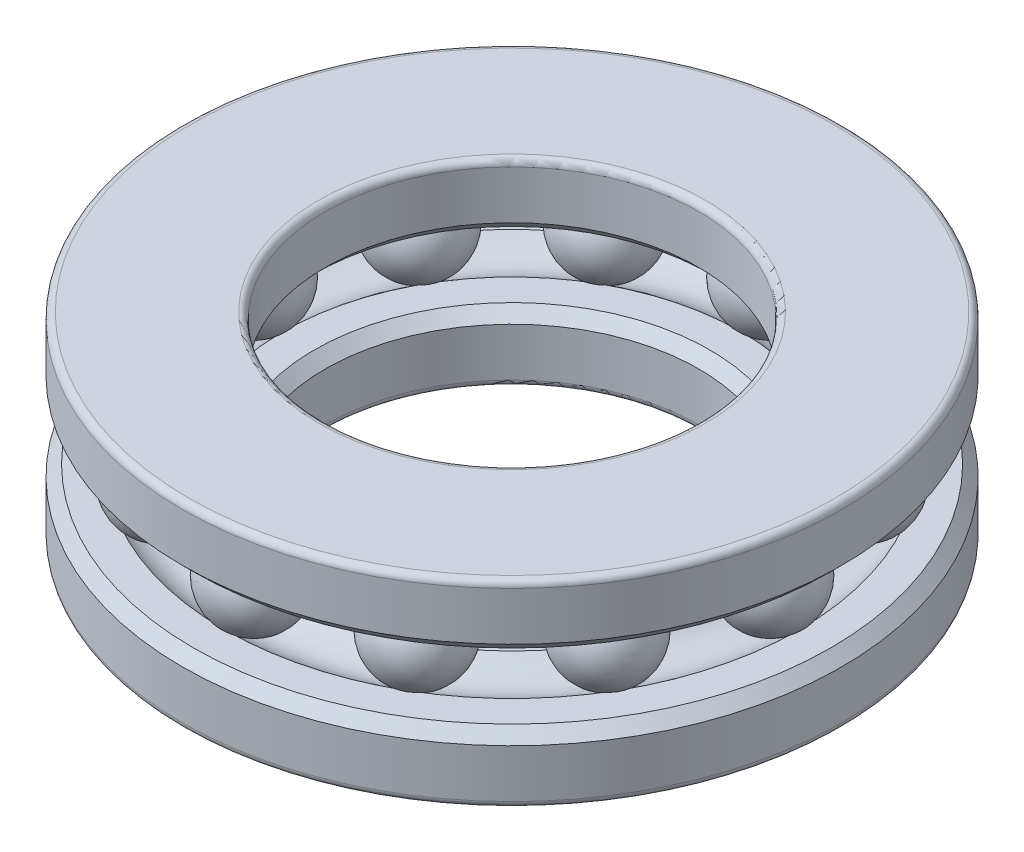
ISO-10303-21;
HEADER;
FILE_DESCRIPTION(('STEP AP214'),'2;1');
FILE_NAME('part.step','',(''),(''),'','','');
FILE_SCHEMA(('AUTOMOTIVE_DESIGN { 1 0 10303 214 1 1 1 1 }'));
ENDSEC;
DATA;
#1=APPLICATION_CONTEXT('core data for automotive mechanical design processes');
#2=APPLICATION_PROTOCOL_DEFINITION('international standard','automotive_design',2000,#1);
#3=PRODUCT_CONTEXT('',#1,'mechanical');
#4=PRODUCT('Part','Part','',(#3));
#5=PRODUCT_RELATED_PRODUCT_CATEGORY('part','',(#4));
#6=PRODUCT_DEFINITION_FORMATION('','',#4);
#7=PRODUCT_DEFINITION_CONTEXT('part definition',#1,'design');
#8=PRODUCT_DEFINITION('design','',#6,#7);
#9=PRODUCT_DEFINITION_SHAPE('','',#8);
#10=(LENGTH_UNIT() NAMED_UNIT(*) SI_UNIT(.MILLI.,.METRE.));
#11=(NAMED_UNIT(*) PLANE_ANGLE_UNIT() SI_UNIT($,.RADIAN.));
#12=(NAMED_UNIT(*) SI_UNIT($,.STERADIAN.) SOLID_ANGLE_UNIT());
#13=UNCERTAINTY_MEASURE_WITH_UNIT(LENGTH_MEASURE(1.E-05),#10,'distance_accuracy_value','');
#14=(GEOMETRIC_REPRESENTATION_CONTEXT(3) GLOBAL_UNCERTAINTY_ASSIGNED_CONTEXT((#13)) GLOBAL_UNIT_ASSIGNED_CONTEXT((#10,
#11,#12)) REPRESENTATION_CONTEXT('',''));
#15=CARTESIAN_POINT('',(0.,0.,0.));
#16=DIRECTION('',(0.,0.,1.));
#17=DIRECTION('',(1.,0.,0.));
#18=AXIS2_PLACEMENT_3D('',#15,#16,#17);
#19=CARTESIAN_POINT('',(5.87499999999987,0.,10.1757984944672));
#20=DIRECTION('',(0.,-1.,0.));
#21=DIRECTION('',(0.499999999999989,0.,0.866025403784445));
#22=AXIS2_PLACEMENT_3D('',#19,#20,#21);
#23=SPHERICAL_SURFACE('',#22,2.05);
#24=CARTESIAN_POINT('',(5.87499999999987,-2.05,10.1757984944672));
#25=VERTEX_POINT('',#24);
#26=VERTEX_LOOP('',#25);
#27=FACE_BOUND('',#26,.T.);
#28=ADVANCED_FACE('F40',(#27),#23,.T.);
#29=CLOSED_SHELL('',(#28));
#30=MANIFOLD_SOLID_BREP('B2',#29);
#31=CARTESIAN_POINT('',(10.1757984944671,0.,5.87500000000012));
#32=DIRECTION('',(0.,-1.,0.));
#33=DIRECTION('',(0.866025403784433,0.,0.50000000000001));
#34=AXIS2_PLACEMENT_3D('',#31,#32,#33);
#35=SPHERICAL_SURFACE('',#34,2.05);
#36=CARTESIAN_POINT('',(10.1757984944671,-2.05,5.87500000000012));
#37=VERTEX_POINT('',#36);
#38=VERTEX_LOOP('',#37);
#39=FACE_BOUND('',#38,.T.);
#40=ADVANCED_FACE('F59',(#39),#35,.T.);
#41=CLOSED_SHELL('',(#40));
#42=MANIFOLD_SOLID_BREP('B6',#41);
#43=CARTESIAN_POINT('',(11.75,0.,1.2307471719422E-13));
#44=DIRECTION('',(0.,-1.,0.));
#45=DIRECTION('',(1.,0.,0.));
#46=AXIS2_PLACEMENT_3D('',#43,#44,#45);
#47=SPHERICAL_SURFACE('',#46,2.05);
#48=CARTESIAN_POINT('',(11.75,-2.05,1.2307471719422E-13));
#49=VERTEX_POINT('',#48);
#50=VERTEX_LOOP('',#49);
#51=FACE_BOUND('',#50,.T.);
#52=ADVANCED_FACE('F78',(#51),#47,.T.);
#53=CLOSED_SHELL('',(#52));
#54=MANIFOLD_SOLID_BREP('B36',#53);
#55=CARTESIAN_POINT('',(10.1757984944672,0.,-5.8749999999999));
#56=DIRECTION('',(0.,-1.,0.));
#57=DIRECTION('',(0.866025403784443,0.,-0.499999999999992));
#58=AXIS2_PLACEMENT_3D('',#55,#56,#57);
#59=SPHERICAL_SURFACE('',#58,2.05);
#60=CARTESIAN_POINT('',(10.1757984944672,-2.05,-5.8749999999999));
#61=VERTEX_POINT('',#60);
#62=VERTEX_LOOP('',#61);
#63=FACE_BOUND('',#62,.T.);
#64=ADVANCED_FACE('F97',(#63),#59,.T.);
#65=CLOSED_SHELL('',(#64));
#66=MANIFOLD_SOLID_BREP('B55',#65);
#67=CARTESIAN_POINT('',(5.87500000000008,0.,-10.1757984944671));
#68=DIRECTION('',(0.,-1.,0.));
#69=DIRECTION('',(0.500000000000007,0.,-0.866025403784435));
#70=AXIS2_PLACEMENT_3D('',#67,#68,#69);
#71=SPHERICAL_SURFACE('',#70,2.05);
#72=CARTESIAN_POINT('',(5.87500000000008,-2.05,-10.1757984944671));
#73=VERTEX_POINT('',#72);
#74=VERTEX_LOOP('',#73);
#75=FACE_BOUND('',#74,.T.);
#76=ADVANCED_FACE('F116',(#75),#71,.T.);
#77=CLOSED_SHELL('',(#76));
#78=MANIFOLD_SOLID_BREP('B74',#77);
#79=CARTESIAN_POINT('',(0.,0.,-11.75));
#80=DIRECTION('',(0.,-1.,0.));
#81=DIRECTION('',(0.,0.,-1.));
#82=AXIS2_PLACEMENT_3D('',#79,#80,#81);
#83=SPHERICAL_SURFACE('',#82,2.05);
#84=CARTESIAN_POINT('',(0.,-2.05,-11.75));
#85=VERTEX_POINT('',#84);
#86=VERTEX_LOOP('',#85);
#87=FACE_BOUND('',#86,.T.);
#88=ADVANCED_FACE('F135',(#87),#83,.T.);
#89=CLOSED_SHELL('',(#88));
#90=MANIFOLD_SOLID_BREP('B93',#89);
#91=CARTESIAN_POINT('',(-5.87499999999994,0.,-10.1757984944672));
#92=DIRECTION('',(0.,-1.,0.));
#93=DIRECTION('',(-0.499999999999995,0.,-0.866025403784442));
#94=AXIS2_PLACEMENT_3D('',#91,#92,#93);
#95=SPHERICAL_SURFACE('',#94,2.05);
#96=CARTESIAN_POINT('',(-5.87499999999994,-2.05,-10.1757984944672));
#97=VERTEX_POINT('',#96);
#98=VERTEX_LOOP('',#97);
#99=FACE_BOUND('',#98,.T.);
#100=ADVANCED_FACE('F154',(#99),#95,.T.);
#101=CLOSED_SHELL('',(#100));
#102=MANIFOLD_SOLID_BREP('B112',#101);
#103=CARTESIAN_POINT('',(-10.1757984944671,0.,-5.87500000000005));
#104=DIRECTION('',(0.,-1.,0.));
#105=DIRECTION('',(-0.866025403784436,0.,-0.500000000000004));
#106=AXIS2_PLACEMENT_3D('',#103,#104,#105);
#107=SPHERICAL_SURFACE('',#106,2.05);
#108=CARTESIAN_POINT('',(-10.1757984944671,-2.05,-5.87500000000005));
#109=VERTEX_POINT('',#108);
#110=VERTEX_LOOP('',#109);
#111=FACE_BOUND('',#110,.T.);
#112=ADVANCED_FACE('F173',(#111),#107,.T.);
#113=CLOSED_SHELL('',(#112));
#114=MANIFOLD_SOLID_BREP('B131',#113);
#115=CARTESIAN_POINT('',(-11.75,0.,0.));
#116=DIRECTION('',(0.,-1.,0.));
#117=DIRECTION('',(-1.,0.,0.));
#118=AXIS2_PLACEMENT_3D('',#115,#116,#117);
#119=SPHERICAL_SURFACE('',#118,2.05);
#120=CARTESIAN_POINT('',(-11.75,-2.05,0.));
#121=VERTEX_POINT('',#120);
#122=VERTEX_LOOP('',#121);
#123=FACE_BOUND('',#122,.T.);
#124=ADVANCED_FACE('F192',(#123),#119,.T.);
#125=CLOSED_SHELL('',(#124));
#126=MANIFOLD_SOLID_BREP('B150',#125);
#127=CARTESIAN_POINT('',(-10.1757984944672,0.,5.87499999999998));
#128=DIRECTION('',(0.,-1.,0.));
#129=DIRECTION('',(-0.86602540378444,0.,0.499999999999998));
#130=AXIS2_PLACEMENT_3D('',#127,#128,#129);
#131=SPHERICAL_SURFACE('',#130,2.05);
#132=CARTESIAN_POINT('',(-10.1757984944672,-2.05,5.87499999999998));
#133=VERTEX_POINT('',#132);
#134=VERTEX_LOOP('',#133);
#135=FACE_BOUND('',#134,.T.);
#136=ADVANCED_FACE('F211',(#135),#131,.T.);
#137=CLOSED_SHELL('',(#136));
#138=MANIFOLD_SOLID_BREP('B169',#137);
#139=CARTESIAN_POINT('',(-5.87500000000001,0.,10.1757984944671));
#140=DIRECTION('',(0.,-1.,0.));
#141=DIRECTION('',(-0.500000000000001,0.,0.866025403784438));
#142=AXIS2_PLACEMENT_3D('',#139,#140,#141);
#143=SPHERICAL_SURFACE('',#142,2.05);
#144=CARTESIAN_POINT('',(-5.87500000000001,-2.05,10.1757984944671));
#145=VERTEX_POINT('',#144);
#146=VERTEX_LOOP('',#145);
#147=FACE_BOUND('',#146,.T.);
#148=ADVANCED_FACE('F230',(#147),#143,.T.);
#149=CLOSED_SHELL('',(#148));
#150=MANIFOLD_SOLID_BREP('B188',#149);
#151=CARTESIAN_POINT('',(0.,0.,11.75));
#152=DIRECTION('',(0.,-1.,0.));
#153=DIRECTION('',(0.,0.,1.));
#154=AXIS2_PLACEMENT_3D('',#151,#152,#153);
#155=SPHERICAL_SURFACE('',#154,2.05);
#156=CARTESIAN_POINT('',(0.,-2.05,11.75));
#157=VERTEX_POINT('',#156);
#158=VERTEX_LOOP('',#157);
#159=FACE_BOUND('',#158,.T.);
#160=ADVANCED_FACE('F251',(#159),#155,.T.);
#161=CLOSED_SHELL('',(#160));
#162=MANIFOLD_SOLID_BREP('B207',#161);
#163=CARTESIAN_POINT('',(0.,0.,0.));
#164=DIRECTION('',(0.,-1.,0.));
#165=DIRECTION('',(0.,0.,-1.));
#166=AXIS2_PLACEMENT_3D('',#163,#164,#165);
#167=TOROIDAL_SURFACE('',#166,11.75,2.);
#168=CARTESIAN_POINT('',(0.,-1.5,0.));
#169=DIRECTION('',(0.,-1.,0.));
#170=DIRECTION('',(0.,0.,-1.));
#171=AXIS2_PLACEMENT_3D('',#168,#169,#170);
#172=CIRCLE('',#171,10.4271243444677);
#173=CARTESIAN_POINT('',(0.,-1.5,-10.4271243444677));
#174=VERTEX_POINT('',#173);
#175=EDGE_CURVE('E307',#174,#174,#172,.T.);
#176=ORIENTED_EDGE('',*,*,#175,.T.);
#177=EDGE_LOOP('',(#176));
#178=FACE_BOUND('',#177,.T.);
#179=CARTESIAN_POINT('',(0.,-1.5,0.));
#180=DIRECTION('',(0.,-1.,0.));
#181=DIRECTION('',(0.,0.,-1.));
#182=AXIS2_PLACEMENT_3D('',#179,#180,#181);
#183=CIRCLE('',#182,13.0728756555323);
#184=CARTESIAN_POINT('',(0.,-1.5,-13.0728756555323));
#185=VERTEX_POINT('',#184);
#186=EDGE_CURVE('E304',#185,#185,#183,.T.);
#187=ORIENTED_EDGE('',*,*,#186,.F.);
#188=EDGE_LOOP('',(#187));
#189=FACE_BOUND('',#188,.T.);
#190=ADVANCED_FACE('F271',(#178,#189),#167,.F.);
#191=CARTESIAN_POINT('',(0.,-1.5,0.));
#192=DIRECTION('',(0.,1.,0.));
#193=DIRECTION('',(0.,0.,1.));
#194=AXIS2_PLACEMENT_3D('',#191,#192,#193);
#195=PLANE('',#194);
#196=CARTESIAN_POINT('',(0.,-1.5,0.));
#197=DIRECTION('',(0.,1.,0.));
#198=DIRECTION('',(0.,0.,1.));
#199=AXIS2_PLACEMENT_3D('',#196,#197,#198);
#200=CIRCLE('',#199,14.5);
#201=CARTESIAN_POINT('',(0.,-1.5,14.5));
#202=VERTEX_POINT('',#201);
#203=EDGE_CURVE('E250',#202,#202,#200,.T.);
#204=ORIENTED_EDGE('',*,*,#203,.T.);
#205=EDGE_LOOP('',(#204));
#206=FACE_BOUND('',#205,.T.);
#207=ORIENTED_EDGE('',*,*,#186,.T.);
#208=EDGE_LOOP('',(#207));
#209=FACE_BOUND('',#208,.T.);
#210=ADVANCED_FACE('F319',(#206,#209),#195,.T.);
#211=CARTESIAN_POINT('',(0.,0.,0.));
#212=DIRECTION('',(0.,-1.,0.));
#213=DIRECTION('',(0.,0.,-1.));
#214=AXIS2_PLACEMENT_3D('',#211,#212,#213);
#215=CYLINDRICAL_SURFACE('',#214,15.);
#216=CARTESIAN_POINT('',(0.,-2.,0.));
#217=DIRECTION('',(0.,1.,0.));
#218=DIRECTION('',(0.,0.,1.));
#219=AXIS2_PLACEMENT_3D('',#216,#217,#218);
#220=CIRCLE('',#219,15.);
#221=CARTESIAN_POINT('',(0.,-2.,15.));
#222=VERTEX_POINT('',#221);
#223=EDGE_CURVE('E279',#222,#222,#220,.F.);
#224=ORIENTED_EDGE('',*,*,#223,.T.);
#225=EDGE_LOOP('',(#224));
#226=FACE_BOUND('',#225,.T.);
#227=CARTESIAN_POINT('',(0.,-4.2,0.));
#228=DIRECTION('',(0.,1.,0.));
#229=DIRECTION('',(0.,0.,1.));
#230=AXIS2_PLACEMENT_3D('',#227,#228,#229);
#231=CIRCLE('',#230,15.);
#232=CARTESIAN_POINT('',(0.,-4.2,15.));
#233=VERTEX_POINT('',#232);
#234=EDGE_CURVE('E295',#233,#233,#231,.T.);
#235=ORIENTED_EDGE('',*,*,#234,.T.);
#236=EDGE_LOOP('',(#235));
#237=FACE_BOUND('',#236,.T.);
#238=ADVANCED_FACE('F331',(#226,#237),#215,.T.);
#239=CARTESIAN_POINT('',(0.,-4.5,0.));
#240=DIRECTION('',(0.,1.,0.));
#241=DIRECTION('',(0.,0.,1.));
#242=AXIS2_PLACEMENT_3D('',#239,#240,#241);
#243=PLANE('',#242);
#244=CARTESIAN_POINT('',(0.,-4.5,0.));
#245=DIRECTION('',(0.,1.,0.));
#246=DIRECTION('',(0.,0.,1.));
#247=AXIS2_PLACEMENT_3D('',#244,#245,#246);
#248=CIRCLE('',#247,14.7);
#249=CARTESIAN_POINT('',(0.,-4.5,14.7));
#250=VERTEX_POINT('',#249);
#251=EDGE_CURVE('E298',#250,#250,#248,.F.);
#252=ORIENTED_EDGE('',*,*,#251,.T.);
#253=EDGE_LOOP('',(#252));
#254=FACE_BOUND('',#253,.T.);
#255=CARTESIAN_POINT('',(0.,-4.5,0.));
#256=DIRECTION('',(0.,1.,0.));
#257=DIRECTION('',(0.,0.,1.));
#258=AXIS2_PLACEMENT_3D('',#255,#256,#257);
#259=CIRCLE('',#258,8.8);
#260=CARTESIAN_POINT('',(0.,-4.5,8.8));
#261=VERTEX_POINT('',#260);
#262=EDGE_CURVE('E301',#261,#261,#259,.T.);
#263=ORIENTED_EDGE('',*,*,#262,.T.);
#264=EDGE_LOOP('',(#263));
#265=FACE_BOUND('',#264,.T.);
#266=ADVANCED_FACE('F327',(#254,#265),#243,.F.);
#267=CARTESIAN_POINT('',(0.,0.,0.));
#268=DIRECTION('',(0.,-1.,0.));
#269=DIRECTION('',(0.,0.,-1.));
#270=AXIS2_PLACEMENT_3D('',#267,#268,#269);
#271=CYLINDRICAL_SURFACE('',#270,8.5);
#272=CARTESIAN_POINT('',(0.,-2.00000000000001,0.));
#273=DIRECTION('',(0.,1.,0.));
#274=DIRECTION('',(0.,0.,1.));
#275=AXIS2_PLACEMENT_3D('',#272,#273,#274);
#276=CIRCLE('',#275,8.5);
#277=CARTESIAN_POINT('',(0.,-2.00000000000001,8.5));
#278=VERTEX_POINT('',#277);
#279=EDGE_CURVE('E283',#278,#278,#276,.T.);
#280=ORIENTED_EDGE('',*,*,#279,.T.);
#281=EDGE_LOOP('',(#280));
#282=FACE_BOUND('',#281,.T.);
#283=CARTESIAN_POINT('',(0.,-4.2,0.));
#284=DIRECTION('',(0.,1.,0.));
#285=DIRECTION('',(0.,0.,1.));
#286=AXIS2_PLACEMENT_3D('',#283,#284,#285);
#287=CIRCLE('',#286,8.5);
#288=CARTESIAN_POINT('',(0.,-4.2,8.5));
#289=VERTEX_POINT('',#288);
#290=EDGE_CURVE('E292',#289,#289,#287,.F.);
#291=ORIENTED_EDGE('',*,*,#290,.T.);
#292=EDGE_LOOP('',(#291));
#293=FACE_BOUND('',#292,.T.);
#294=ADVANCED_FACE('F316',(#282,#293),#271,.F.);
#295=CARTESIAN_POINT('',(0.,-1.5,0.));
#296=DIRECTION('',(0.,1.,0.));
#297=DIRECTION('',(0.,0.,1.));
#298=AXIS2_PLACEMENT_3D('',#295,#296,#297);
#299=CIRCLE('',#298,9.);
#300=CARTESIAN_POINT('',(0.,-1.5,9.));
#301=VERTEX_POINT('',#300);
#302=EDGE_CURVE('E287',#301,#301,#299,.F.);
#303=ORIENTED_EDGE('',*,*,#302,.T.);
#304=EDGE_LOOP('',(#303));
#305=FACE_BOUND('',#304,.T.);
#306=ORIENTED_EDGE('',*,*,#175,.F.);
#307=EDGE_LOOP('',(#306));
#308=FACE_BOUND('',#307,.T.);
#309=ADVANCED_FACE('F313',(#305,#308),#195,.T.);
#310=CARTESIAN_POINT('',(0.,-4.2,0.));
#311=DIRECTION('',(0.,1.,0.));
#312=DIRECTION('',(0.,0.,1.));
#313=AXIS2_PLACEMENT_3D('',#310,#311,#312);
#314=TOROIDAL_SURFACE('',#313,14.7,0.3);
#315=ORIENTED_EDGE('',*,*,#234,.F.);
#316=EDGE_LOOP('',(#315));
#317=FACE_BOUND('',#316,.T.);
#318=ORIENTED_EDGE('',*,*,#251,.F.);
#319=EDGE_LOOP('',(#318));
#320=FACE_BOUND('',#319,.T.);
#321=ADVANCED_FACE('F315',(#317,#320),#314,.T.);
#322=CARTESIAN_POINT('',(0.,-4.2,0.));
#323=DIRECTION('',(0.,1.,0.));
#324=DIRECTION('',(0.,0.,1.));
#325=AXIS2_PLACEMENT_3D('',#322,#323,#324);
#326=TOROIDAL_SURFACE('',#325,8.8,0.3);
#327=ORIENTED_EDGE('',*,*,#262,.F.);
#328=EDGE_LOOP('',(#327));
#329=FACE_BOUND('',#328,.T.);
#330=ORIENTED_EDGE('',*,*,#290,.F.);
#331=EDGE_LOOP('',(#330));
#332=FACE_BOUND('',#331,.T.);
#333=ADVANCED_FACE('F324',(#329,#332),#326,.T.);
#334=CARTESIAN_POINT('',(0.,-1.5,0.));
#335=DIRECTION('',(0.,1.,0.));
#336=DIRECTION('',(0.,0.,1.));
#337=AXIS2_PLACEMENT_3D('',#334,#335,#336);
#338=CONICAL_SURFACE('',#337,9.,0.785398163397447);
#339=ORIENTED_EDGE('',*,*,#279,.F.);
#340=EDGE_LOOP('',(#339));
#341=FACE_BOUND('',#340,.T.);
#342=ORIENTED_EDGE('',*,*,#302,.F.);
#343=EDGE_LOOP('',(#342));
#344=FACE_BOUND('',#343,.T.);
#345=ADVANCED_FACE('F340',(#341,#344),#338,.F.);
#346=CARTESIAN_POINT('',(0.,-2.,0.));
#347=DIRECTION('',(0.,-1.,0.));
#348=DIRECTION('',(0.,0.,-1.));
#349=AXIS2_PLACEMENT_3D('',#346,#347,#348);
#350=CONICAL_SURFACE('',#349,15.,0.78539816339745);
#351=ORIENTED_EDGE('',*,*,#203,.F.);
#352=EDGE_LOOP('',(#351));
#353=FACE_BOUND('',#352,.T.);
#354=ORIENTED_EDGE('',*,*,#223,.F.);
#355=EDGE_LOOP('',(#354));
#356=FACE_BOUND('',#355,.T.);
#357=ADVANCED_FACE('F274',(#353,#356),#350,.T.);
#358=CLOSED_SHELL('',(#190,#210,#238,#266,#294,#309,#321,#333,#345,#357));
#359=MANIFOLD_SOLID_BREP('B226',#358);
#360=CARTESIAN_POINT('',(0.,0.,0.));
#361=DIRECTION('',(0.,-1.,0.));
#362=DIRECTION('',(0.,0.,-1.));
#363=AXIS2_PLACEMENT_3D('',#360,#361,#362);
#364=TOROIDAL_SURFACE('',#363,11.75,2.);
#365=CARTESIAN_POINT('',(0.,1.5,0.));
#366=DIRECTION('',(0.,-1.,0.));
#367=DIRECTION('',(0.,0.,-1.));
#368=AXIS2_PLACEMENT_3D('',#365,#366,#367);
#369=CIRCLE('',#368,13.0728756555323);
#370=CARTESIAN_POINT('',(0.,1.5,-13.0728756555323));
#371=VERTEX_POINT('',#370);
#372=EDGE_CURVE('E464',#371,#371,#369,.T.);
#373=ORIENTED_EDGE('',*,*,#372,.T.);
#374=EDGE_LOOP('',(#373));
#375=FACE_BOUND('',#374,.T.);
#376=CARTESIAN_POINT('',(0.,1.5,0.));
#377=DIRECTION('',(0.,-1.,0.));
#378=DIRECTION('',(0.,0.,-1.));
#379=AXIS2_PLACEMENT_3D('',#376,#377,#378);
#380=CIRCLE('',#379,10.4271243444677);
#381=CARTESIAN_POINT('',(0.,1.5,-10.4271243444677));
#382=VERTEX_POINT('',#381);
#383=EDGE_CURVE('E461',#382,#382,#380,.T.);
#384=ORIENTED_EDGE('',*,*,#383,.F.);
#385=EDGE_LOOP('',(#384));
#386=FACE_BOUND('',#385,.T.);
#387=ADVANCED_FACE('F428',(#375,#386),#364,.F.);
#388=CARTESIAN_POINT('',(0.,1.5,0.));
#389=DIRECTION('',(0.,1.,0.));
#390=DIRECTION('',(0.,0.,1.));
#391=AXIS2_PLACEMENT_3D('',#388,#389,#390);
#392=PLANE('',#391);
#393=CARTESIAN_POINT('',(0.,1.5,0.));
#394=DIRECTION('',(0.,1.,0.));
#395=DIRECTION('',(0.,0.,1.));
#396=AXIS2_PLACEMENT_3D('',#393,#394,#395);
#397=CIRCLE('',#396,9.00000000000001);
#398=CARTESIAN_POINT('',(0.,1.5,9.00000000000001));
#399=VERTEX_POINT('',#398);
#400=EDGE_CURVE('E440',#399,#399,#397,.T.);
#401=ORIENTED_EDGE('',*,*,#400,.T.);
#402=EDGE_LOOP('',(#401));
#403=FACE_BOUND('',#402,.T.);
#404=ORIENTED_EDGE('',*,*,#383,.T.);
#405=EDGE_LOOP('',(#404));
#406=FACE_BOUND('',#405,.T.);
#407=ADVANCED_FACE('F475',(#403,#406),#392,.F.);
#408=CARTESIAN_POINT('',(0.,0.,0.));
#409=DIRECTION('',(0.,-1.,0.));
#410=DIRECTION('',(0.,0.,-1.));
#411=AXIS2_PLACEMENT_3D('',#408,#409,#410);
#412=CYLINDRICAL_SURFACE('',#411,8.5);
#413=CARTESIAN_POINT('',(0.,2.,0.));
#414=DIRECTION('',(0.,1.,0.));
#415=DIRECTION('',(0.,0.,1.));
#416=AXIS2_PLACEMENT_3D('',#413,#414,#415);
#417=CIRCLE('',#416,8.5);
#418=CARTESIAN_POINT('',(0.,2.,8.5));
#419=VERTEX_POINT('',#418);
#420=EDGE_CURVE('E444',#419,#419,#417,.F.);
#421=ORIENTED_EDGE('',*,*,#420,.T.);
#422=EDGE_LOOP('',(#421));
#423=FACE_BOUND('',#422,.T.);
#424=CARTESIAN_POINT('',(0.,4.2,0.));
#425=DIRECTION('',(0.,1.,0.));
#426=DIRECTION('',(0.,0.,1.));
#427=AXIS2_PLACEMENT_3D('',#424,#425,#426);
#428=CIRCLE('',#427,8.5);
#429=CARTESIAN_POINT('',(0.,4.2,8.5));
#430=VERTEX_POINT('',#429);
#431=EDGE_CURVE('E452',#430,#430,#428,.T.);
#432=ORIENTED_EDGE('',*,*,#431,.T.);
#433=EDGE_LOOP('',(#432));
#434=FACE_BOUND('',#433,.T.);
#435=ADVANCED_FACE('F486',(#423,#434),#412,.F.);
#436=CARTESIAN_POINT('',(0.,4.5,0.));
#437=DIRECTION('',(0.,1.,0.));
#438=DIRECTION('',(0.,0.,1.));
#439=AXIS2_PLACEMENT_3D('',#436,#437,#438);
#440=PLANE('',#439);
#441=CARTESIAN_POINT('',(0.,4.5,0.));
#442=DIRECTION('',(0.,1.,0.));
#443=DIRECTION('',(0.,0.,1.));
#444=AXIS2_PLACEMENT_3D('',#441,#442,#443);
#445=CIRCLE('',#444,8.8);
#446=CARTESIAN_POINT('',(0.,4.5,8.8));
#447=VERTEX_POINT('',#446);
#448=EDGE_CURVE('E455',#447,#447,#445,.F.);
#449=ORIENTED_EDGE('',*,*,#448,.T.);
#450=EDGE_LOOP('',(#449));
#451=FACE_BOUND('',#450,.T.);
#452=CARTESIAN_POINT('',(0.,4.5,0.));
#453=DIRECTION('',(0.,1.,0.));
#454=DIRECTION('',(0.,0.,1.));
#455=AXIS2_PLACEMENT_3D('',#452,#453,#454);
#456=CIRCLE('',#455,14.7);
#457=CARTESIAN_POINT('',(0.,4.5,14.7));
#458=VERTEX_POINT('',#457);
#459=EDGE_CURVE('E458',#458,#458,#456,.T.);
#460=ORIENTED_EDGE('',*,*,#459,.T.);
#461=EDGE_LOOP('',(#460));
#462=FACE_BOUND('',#461,.T.);
#463=ADVANCED_FACE('F483',(#451,#462),#440,.T.);
#464=CARTESIAN_POINT('',(0.,0.,0.));
#465=DIRECTION('',(0.,-1.,0.));
#466=DIRECTION('',(0.,0.,-1.));
#467=AXIS2_PLACEMENT_3D('',#464,#465,#466);
#468=CYLINDRICAL_SURFACE('',#467,15.);
#469=CARTESIAN_POINT('',(0.,2.,0.));
#470=DIRECTION('',(0.,1.,0.));
#471=DIRECTION('',(0.,0.,1.));
#472=AXIS2_PLACEMENT_3D('',#469,#470,#471);
#473=CIRCLE('',#472,15.);
#474=CARTESIAN_POINT('',(0.,2.,15.));
#475=VERTEX_POINT('',#474);
#476=EDGE_CURVE('E270',#475,#475,#473,.T.);
#477=ORIENTED_EDGE('',*,*,#476,.T.);
#478=EDGE_LOOP('',(#477));
#479=FACE_BOUND('',#478,.T.);
#480=CARTESIAN_POINT('',(0.,4.2,0.));
#481=DIRECTION('',(0.,1.,0.));
#482=DIRECTION('',(0.,0.,1.));
#483=AXIS2_PLACEMENT_3D('',#480,#481,#482);
#484=CIRCLE('',#483,15.);
#485=CARTESIAN_POINT('',(0.,4.2,15.));
#486=VERTEX_POINT('',#485);
#487=EDGE_CURVE('E449',#486,#486,#484,.F.);
#488=ORIENTED_EDGE('',*,*,#487,.T.);
#489=EDGE_LOOP('',(#488));
#490=FACE_BOUND('',#489,.T.);
#491=ADVANCED_FACE('F473',(#479,#490),#468,.T.);
#492=CARTESIAN_POINT('',(0.,1.5,0.));
#493=DIRECTION('',(0.,1.,0.));
#494=DIRECTION('',(0.,0.,1.));
#495=AXIS2_PLACEMENT_3D('',#492,#493,#494);
#496=CIRCLE('',#495,14.5);
#497=CARTESIAN_POINT('',(0.,1.5,14.5));
#498=VERTEX_POINT('',#497);
#499=EDGE_CURVE('E436',#498,#498,#496,.F.);
#500=ORIENTED_EDGE('',*,*,#499,.T.);
#501=EDGE_LOOP('',(#500));
#502=FACE_BOUND('',#501,.T.);
#503=ORIENTED_EDGE('',*,*,#372,.F.);
#504=EDGE_LOOP('',(#503));
#505=FACE_BOUND('',#504,.T.);
#506=ADVANCED_FACE('F470',(#502,#505),#392,.F.);
#507=CARTESIAN_POINT('',(0.,4.2,0.));
#508=DIRECTION('',(0.,1.,0.));
#509=DIRECTION('',(0.,0.,1.));
#510=AXIS2_PLACEMENT_3D('',#507,#508,#509);
#511=TOROIDAL_SURFACE('',#510,8.8,0.3);
#512=ORIENTED_EDGE('',*,*,#431,.F.);
#513=EDGE_LOOP('',(#512));
#514=FACE_BOUND('',#513,.T.);
#515=ORIENTED_EDGE('',*,*,#448,.F.);
#516=EDGE_LOOP('',(#515));
#517=FACE_BOUND('',#516,.T.);
#518=ADVANCED_FACE('F472',(#514,#517),#511,.T.);
#519=CARTESIAN_POINT('',(0.,4.2,0.));
#520=DIRECTION('',(0.,1.,0.));
#521=DIRECTION('',(0.,0.,1.));
#522=AXIS2_PLACEMENT_3D('',#519,#520,#521);
#523=TOROIDAL_SURFACE('',#522,14.7,0.3);
#524=ORIENTED_EDGE('',*,*,#459,.F.);
#525=EDGE_LOOP('',(#524));
#526=FACE_BOUND('',#525,.T.);
#527=ORIENTED_EDGE('',*,*,#487,.F.);
#528=EDGE_LOOP('',(#527));
#529=FACE_BOUND('',#528,.T.);
#530=ADVANCED_FACE('F480',(#526,#529),#523,.T.);
#531=CARTESIAN_POINT('',(0.,2.,0.));
#532=DIRECTION('',(0.,-1.,0.));
#533=DIRECTION('',(0.,0.,-1.));
#534=AXIS2_PLACEMENT_3D('',#531,#532,#533);
#535=CONICAL_SURFACE('',#534,8.5,0.785398163397454);
#536=ORIENTED_EDGE('',*,*,#400,.F.);
#537=EDGE_LOOP('',(#536));
#538=FACE_BOUND('',#537,.T.);
#539=ORIENTED_EDGE('',*,*,#420,.F.);
#540=EDGE_LOOP('',(#539));
#541=FACE_BOUND('',#540,.T.);
#542=ADVANCED_FACE('F496',(#538,#541),#535,.F.);
#543=CARTESIAN_POINT('',(0.,1.5,0.));
#544=DIRECTION('',(0.,1.,0.));
#545=DIRECTION('',(0.,0.,1.));
#546=AXIS2_PLACEMENT_3D('',#543,#544,#545);
#547=CONICAL_SURFACE('',#546,14.5,0.785398163397454);
#548=ORIENTED_EDGE('',*,*,#476,.F.);
#549=EDGE_LOOP('',(#548));
#550=FACE_BOUND('',#549,.T.);
#551=ORIENTED_EDGE('',*,*,#499,.F.);
#552=EDGE_LOOP('',(#551));
#553=FACE_BOUND('',#552,.T.);
#554=ADVANCED_FACE('F431',(#550,#553),#547,.T.);
#555=CLOSED_SHELL('',(#387,#407,#435,#463,#491,#506,#518,#530,#542,#554));
#556=MANIFOLD_SOLID_BREP('B245',#555);
#557=ADVANCED_BREP_SHAPE_REPRESENTATION('',(#18,#30,#42,#54,#66,#78,#90,#102,#114,#126,#138,
#150,#162,#359,#556),#14);
#558=SHAPE_DEFINITION_REPRESENTATION(#9,#557);
ENDSEC;
END-ISO-10303-21;
